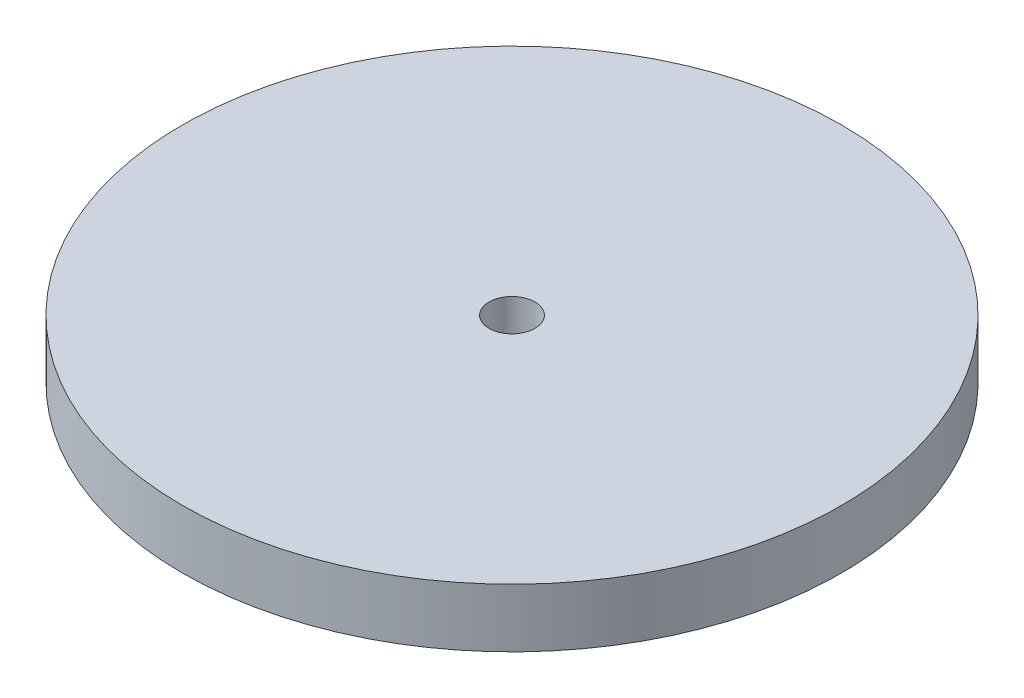
ISO-10303-21;
HEADER;
FILE_DESCRIPTION(('STEP AP214'),'2;1');
FILE_NAME('part.step','',(''),(''),'','','');
FILE_SCHEMA(('AUTOMOTIVE_DESIGN { 1 0 10303 214 1 1 1 1 }'));
ENDSEC;
DATA;
#1=APPLICATION_CONTEXT('core data for automotive mechanical design processes');
#2=APPLICATION_PROTOCOL_DEFINITION('international standard','automotive_design',2000,#1);
#3=PRODUCT_CONTEXT('',#1,'mechanical');
#4=PRODUCT('Part','Part','',(#3));
#5=PRODUCT_RELATED_PRODUCT_CATEGORY('part','',(#4));
#6=PRODUCT_DEFINITION_FORMATION('','',#4);
#7=PRODUCT_DEFINITION_CONTEXT('part definition',#1,'design');
#8=PRODUCT_DEFINITION('design','',#6,#7);
#9=PRODUCT_DEFINITION_SHAPE('','',#8);
#10=(LENGTH_UNIT() NAMED_UNIT(*) SI_UNIT(.MILLI.,.METRE.));
#11=(NAMED_UNIT(*) PLANE_ANGLE_UNIT() SI_UNIT($,.RADIAN.));
#12=(NAMED_UNIT(*) SI_UNIT($,.STERADIAN.) SOLID_ANGLE_UNIT());
#13=UNCERTAINTY_MEASURE_WITH_UNIT(LENGTH_MEASURE(1.E-05),#10,'distance_accuracy_value','');
#14=(GEOMETRIC_REPRESENTATION_CONTEXT(3) GLOBAL_UNCERTAINTY_ASSIGNED_CONTEXT((#13)) GLOBAL_UNIT_ASSIGNED_CONTEXT((#10,
#11,#12)) REPRESENTATION_CONTEXT('',''));
#15=CARTESIAN_POINT('',(0.,0.,0.));
#16=DIRECTION('',(0.,0.,1.));
#17=DIRECTION('',(1.,0.,0.));
#18=AXIS2_PLACEMENT_3D('',#15,#16,#17);
#19=CARTESIAN_POINT('',(0.,3.2,0.));
#20=DIRECTION('',(0.,-1.,0.));
#21=DIRECTION('',(0.,0.,-1.));
#22=AXIS2_PLACEMENT_3D('',#19,#20,#21);
#23=CYLINDRICAL_SURFACE('',#22,18.);
#24=CARTESIAN_POINT('',(0.,3.2,0.));
#25=DIRECTION('',(0.,1.,0.));
#26=DIRECTION('',(0.,0.,1.));
#27=AXIS2_PLACEMENT_3D('',#24,#25,#26);
#28=CIRCLE('',#27,18.);
#29=CARTESIAN_POINT('',(0.,3.2,18.));
#30=VERTEX_POINT('',#29);
#31=EDGE_CURVE('E10',#30,#30,#28,.T.);
#32=ORIENTED_EDGE('',*,*,#31,.F.);
#33=EDGE_LOOP('',(#32));
#34=FACE_BOUND('',#33,.T.);
#35=CARTESIAN_POINT('',(0.,0.,0.));
#36=DIRECTION('',(0.,1.,0.));
#37=DIRECTION('',(0.,0.,1.));
#38=AXIS2_PLACEMENT_3D('',#35,#36,#37);
#39=CIRCLE('',#38,18.);
#40=CARTESIAN_POINT('',(0.,0.,18.));
#41=VERTEX_POINT('',#40);
#42=EDGE_CURVE('E38',#41,#41,#39,.T.);
#43=ORIENTED_EDGE('',*,*,#42,.T.);
#44=EDGE_LOOP('',(#43));
#45=FACE_BOUND('',#44,.T.);
#46=ADVANCED_FACE('F35',(#34,#45),#23,.T.);
#47=CARTESIAN_POINT('',(0.,3.2,0.));
#48=DIRECTION('',(0.,1.,0.));
#49=DIRECTION('',(0.,0.,1.));
#50=AXIS2_PLACEMENT_3D('',#47,#48,#49);
#51=PLANE('',#50);
#52=CARTESIAN_POINT('',(0.,3.2,0.));
#53=DIRECTION('',(0.,1.,0.));
#54=DIRECTION('',(0.,0.,1.));
#55=AXIS2_PLACEMENT_3D('',#52,#53,#54);
#56=CIRCLE('',#55,1.2525);
#57=CARTESIAN_POINT('',(0.,3.2,1.2525));
#58=VERTEX_POINT('',#57);
#59=EDGE_CURVE('E47',#58,#58,#56,.T.);
#60=ORIENTED_EDGE('',*,*,#59,.F.);
#61=EDGE_LOOP('',(#60));
#62=FACE_BOUND('',#61,.T.);
#63=ORIENTED_EDGE('',*,*,#31,.T.);
#64=EDGE_LOOP('',(#63));
#65=FACE_BOUND('',#64,.T.);
#66=ADVANCED_FACE('F62',(#62,#65),#51,.T.);
#67=CARTESIAN_POINT('',(0.,0.,0.));
#68=DIRECTION('',(0.,1.,0.));
#69=DIRECTION('',(0.,0.,1.));
#70=AXIS2_PLACEMENT_3D('',#67,#68,#69);
#71=PLANE('',#70);
#72=CARTESIAN_POINT('',(0.,0.,0.));
#73=DIRECTION('',(0.,1.,0.));
#74=DIRECTION('',(0.,0.,1.));
#75=AXIS2_PLACEMENT_3D('',#72,#73,#74);
#76=CIRCLE('',#75,1.2525);
#77=CARTESIAN_POINT('',(0.,0.,1.2525));
#78=VERTEX_POINT('',#77);
#79=EDGE_CURVE('E45',#78,#78,#76,.T.);
#80=ORIENTED_EDGE('',*,*,#79,.T.);
#81=EDGE_LOOP('',(#80));
#82=FACE_BOUND('',#81,.T.);
#83=ORIENTED_EDGE('',*,*,#42,.F.);
#84=EDGE_LOOP('',(#83));
#85=FACE_BOUND('',#84,.T.);
#86=ADVANCED_FACE('F53',(#82,#85),#71,.F.);
#87=CARTESIAN_POINT('',(0.,0.,0.));
#88=DIRECTION('',(0.,1.,0.));
#89=DIRECTION('',(0.,0.,1.));
#90=AXIS2_PLACEMENT_3D('',#87,#88,#89);
#91=CYLINDRICAL_SURFACE('',#90,1.2525);
#92=ORIENTED_EDGE('',*,*,#79,.F.);
#93=EDGE_LOOP('',(#92));
#94=FACE_BOUND('',#93,.T.);
#95=ORIENTED_EDGE('',*,*,#59,.T.);
#96=EDGE_LOOP('',(#95));
#97=FACE_BOUND('',#96,.T.);
#98=ADVANCED_FACE('F56',(#94,#97),#91,.F.);
#99=CLOSED_SHELL('',(#46,#66,#86,#98));
#100=MANIFOLD_SOLID_BREP('B2',#99);
#101=ADVANCED_BREP_SHAPE_REPRESENTATION('',(#18,#100),#14);
#102=SHAPE_DEFINITION_REPRESENTATION(#9,#101);
ENDSEC;
END-ISO-10303-21;
